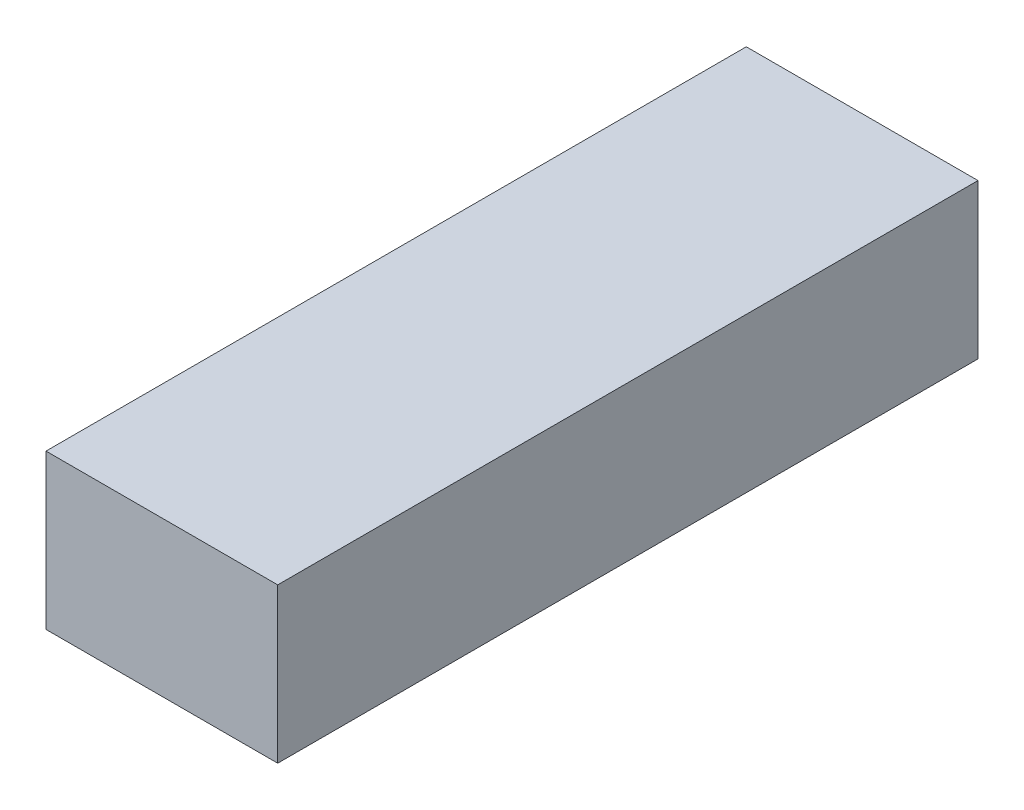
ISO-10303-21;
HEADER;
FILE_DESCRIPTION(('STEP AP214'),'2;1');
FILE_NAME('part.step','',(''),(''),'','','');
FILE_SCHEMA(('AUTOMOTIVE_DESIGN { 1 0 10303 214 1 1 1 1 }'));
ENDSEC;
DATA;
#1=APPLICATION_CONTEXT('core data for automotive mechanical design processes');
#2=APPLICATION_PROTOCOL_DEFINITION('international standard','automotive_design',2000,#1);
#3=PRODUCT_CONTEXT('',#1,'mechanical');
#4=PRODUCT('Part','Part','',(#3));
#5=PRODUCT_RELATED_PRODUCT_CATEGORY('part','',(#4));
#6=PRODUCT_DEFINITION_FORMATION('','',#4);
#7=PRODUCT_DEFINITION_CONTEXT('part definition',#1,'design');
#8=PRODUCT_DEFINITION('design','',#6,#7);
#9=PRODUCT_DEFINITION_SHAPE('','',#8);
#10=(LENGTH_UNIT() NAMED_UNIT(*) SI_UNIT(.MILLI.,.METRE.));
#11=(NAMED_UNIT(*) PLANE_ANGLE_UNIT() SI_UNIT($,.RADIAN.));
#12=(NAMED_UNIT(*) SI_UNIT($,.STERADIAN.) SOLID_ANGLE_UNIT());
#13=UNCERTAINTY_MEASURE_WITH_UNIT(LENGTH_MEASURE(1.E-05),#10,'distance_accuracy_value','');
#14=(GEOMETRIC_REPRESENTATION_CONTEXT(3) GLOBAL_UNCERTAINTY_ASSIGNED_CONTEXT((#13)) GLOBAL_UNIT_ASSIGNED_CONTEXT((#10,
#11,#12)) REPRESENTATION_CONTEXT('',''));
#15=CARTESIAN_POINT('',(0.,0.,0.));
#16=DIRECTION('',(0.,0.,1.));
#17=DIRECTION('',(1.,0.,0.));
#18=AXIS2_PLACEMENT_3D('',#15,#16,#17);
#19=CARTESIAN_POINT('',(22.5,-15.,136.));
#20=DIRECTION('',(-1.,0.,0.));
#21=DIRECTION('',(0.,0.,1.));
#22=AXIS2_PLACEMENT_3D('',#19,#20,#21);
#23=PLANE('',#22);
#24=DIRECTION('',(0.,1.,0.));
#25=VECTOR('',#24,1.);
#26=CARTESIAN_POINT('',(22.5,-15.,0.));
#27=LINE('',#26,#25);
#28=CARTESIAN_POINT('',(22.5,-15.,0.));
#29=VERTEX_POINT('',#28);
#30=CARTESIAN_POINT('',(22.5,15.,0.));
#31=VERTEX_POINT('',#30);
#32=EDGE_CURVE('E99',#29,#31,#27,.T.);
#33=ORIENTED_EDGE('',*,*,#32,.T.);
#34=DIRECTION('',(0.,0.,-1.));
#35=VECTOR('',#34,1.);
#36=CARTESIAN_POINT('',(22.5,15.,136.));
#37=LINE('',#36,#35);
#38=CARTESIAN_POINT('',(22.5,15.,136.));
#39=VERTEX_POINT('',#38);
#40=EDGE_CURVE('E11',#39,#31,#37,.T.);
#41=ORIENTED_EDGE('',*,*,#40,.F.);
#42=DIRECTION('',(0.,1.,0.));
#43=VECTOR('',#42,1.);
#44=CARTESIAN_POINT('',(22.5,-15.,136.));
#45=LINE('',#44,#43);
#46=CARTESIAN_POINT('',(22.5,-15.,136.));
#47=VERTEX_POINT('',#46);
#48=EDGE_CURVE('E87',#47,#39,#45,.T.);
#49=ORIENTED_EDGE('',*,*,#48,.F.);
#50=DIRECTION('',(0.,0.,-1.));
#51=VECTOR('',#50,1.);
#52=CARTESIAN_POINT('',(22.5,-15.,136.));
#53=LINE('',#52,#51);
#54=EDGE_CURVE('E95',#47,#29,#53,.T.);
#55=ORIENTED_EDGE('',*,*,#54,.T.);
#56=EDGE_LOOP('',(#33,#41,#49,#55));
#57=FACE_BOUND('',#56,.T.);
#58=ADVANCED_FACE('F36',(#57),#23,.F.);
#59=CARTESIAN_POINT('',(-22.5,15.,136.));
#60=DIRECTION('',(0.,-1.,0.));
#61=DIRECTION('',(0.,0.,-1.));
#62=AXIS2_PLACEMENT_3D('',#59,#60,#61);
#63=PLANE('',#62);
#64=DIRECTION('',(-1.,0.,0.));
#65=VECTOR('',#64,1.);
#66=CARTESIAN_POINT('',(-22.5,15.,0.));
#67=LINE('',#66,#65);
#68=CARTESIAN_POINT('',(-22.5,15.,0.));
#69=VERTEX_POINT('',#68);
#70=EDGE_CURVE('E91',#31,#69,#67,.T.);
#71=ORIENTED_EDGE('',*,*,#70,.T.);
#72=DIRECTION('',(0.,0.,-1.));
#73=VECTOR('',#72,1.);
#74=CARTESIAN_POINT('',(-22.5,15.,136.));
#75=LINE('',#74,#73);
#76=CARTESIAN_POINT('',(-22.5,15.,136.));
#77=VERTEX_POINT('',#76);
#78=EDGE_CURVE('E44',#77,#69,#75,.T.);
#79=ORIENTED_EDGE('',*,*,#78,.F.);
#80=DIRECTION('',(-1.,0.,0.));
#81=VECTOR('',#80,1.);
#82=CARTESIAN_POINT('',(-22.5,15.,136.));
#83=LINE('',#82,#81);
#84=EDGE_CURVE('E82',#39,#77,#83,.T.);
#85=ORIENTED_EDGE('',*,*,#84,.F.);
#86=ORIENTED_EDGE('',*,*,#40,.T.);
#87=EDGE_LOOP('',(#71,#79,#85,#86));
#88=FACE_BOUND('',#87,.T.);
#89=ADVANCED_FACE('F90',(#88),#63,.F.);
#90=CARTESIAN_POINT('',(-22.5,-15.,136.));
#91=DIRECTION('',(1.,0.,0.));
#92=DIRECTION('',(0.,0.,-1.));
#93=AXIS2_PLACEMENT_3D('',#90,#91,#92);
#94=PLANE('',#93);
#95=DIRECTION('',(0.,-1.,0.));
#96=VECTOR('',#95,1.);
#97=CARTESIAN_POINT('',(-22.5,-15.,0.));
#98=LINE('',#97,#96);
#99=CARTESIAN_POINT('',(-22.5,-15.,0.));
#100=VERTEX_POINT('',#99);
#101=EDGE_CURVE('E69',#69,#100,#98,.T.);
#102=ORIENTED_EDGE('',*,*,#101,.T.);
#103=DIRECTION('',(0.,0.,-1.));
#104=VECTOR('',#103,1.);
#105=CARTESIAN_POINT('',(-22.5,-15.,136.));
#106=LINE('',#105,#104);
#107=CARTESIAN_POINT('',(-22.5,-15.,136.));
#108=VERTEX_POINT('',#107);
#109=EDGE_CURVE('E92',#108,#100,#106,.T.);
#110=ORIENTED_EDGE('',*,*,#109,.F.);
#111=DIRECTION('',(0.,-1.,0.));
#112=VECTOR('',#111,1.);
#113=CARTESIAN_POINT('',(-22.5,-15.,136.));
#114=LINE('',#113,#112);
#115=EDGE_CURVE('E85',#77,#108,#114,.T.);
#116=ORIENTED_EDGE('',*,*,#115,.F.);
#117=ORIENTED_EDGE('',*,*,#78,.T.);
#118=EDGE_LOOP('',(#102,#110,#116,#117));
#119=FACE_BOUND('',#118,.T.);
#120=ADVANCED_FACE('F93',(#119),#94,.F.);
#121=CARTESIAN_POINT('',(-22.5,-15.,136.));
#122=DIRECTION('',(0.,1.,0.));
#123=DIRECTION('',(0.,0.,1.));
#124=AXIS2_PLACEMENT_3D('',#121,#122,#123);
#125=PLANE('',#124);
#126=DIRECTION('',(1.,0.,0.));
#127=VECTOR('',#126,1.);
#128=CARTESIAN_POINT('',(-22.5,-15.,0.));
#129=LINE('',#128,#127);
#130=EDGE_CURVE('E75',#100,#29,#129,.T.);
#131=ORIENTED_EDGE('',*,*,#130,.T.);
#132=ORIENTED_EDGE('',*,*,#54,.F.);
#133=DIRECTION('',(1.,0.,0.));
#134=VECTOR('',#133,1.);
#135=CARTESIAN_POINT('',(-22.5,-15.,136.));
#136=LINE('',#135,#134);
#137=EDGE_CURVE('E52',#108,#47,#136,.T.);
#138=ORIENTED_EDGE('',*,*,#137,.F.);
#139=ORIENTED_EDGE('',*,*,#109,.T.);
#140=EDGE_LOOP('',(#131,#132,#138,#139));
#141=FACE_BOUND('',#140,.T.);
#142=ADVANCED_FACE('F106',(#141),#125,.F.);
#143=CARTESIAN_POINT('',(0.,0.,136.));
#144=DIRECTION('',(0.,0.,-1.));
#145=DIRECTION('',(-1.,0.,0.));
#146=AXIS2_PLACEMENT_3D('',#143,#144,#145);
#147=PLANE('',#146);
#148=ORIENTED_EDGE('',*,*,#48,.T.);
#149=ORIENTED_EDGE('',*,*,#84,.T.);
#150=ORIENTED_EDGE('',*,*,#115,.T.);
#151=ORIENTED_EDGE('',*,*,#137,.T.);
#152=EDGE_LOOP('',(#148,#149,#150,#151));
#153=FACE_BOUND('',#152,.T.);
#154=ADVANCED_FACE('F83',(#153),#147,.F.);
#155=CARTESIAN_POINT('',(0.,0.,0.));
#156=DIRECTION('',(0.,0.,-1.));
#157=DIRECTION('',(-1.,0.,0.));
#158=AXIS2_PLACEMENT_3D('',#155,#156,#157);
#159=PLANE('',#158);
#160=ORIENTED_EDGE('',*,*,#32,.F.);
#161=ORIENTED_EDGE('',*,*,#130,.F.);
#162=ORIENTED_EDGE('',*,*,#101,.F.);
#163=ORIENTED_EDGE('',*,*,#70,.F.);
#164=EDGE_LOOP('',(#160,#161,#162,#163));
#165=FACE_BOUND('',#164,.T.);
#166=ADVANCED_FACE('F109',(#165),#159,.T.);
#167=CLOSED_SHELL('',(#58,#89,#120,#142,#154,#166));
#168=MANIFOLD_SOLID_BREP('B2',#167);
#169=ADVANCED_BREP_SHAPE_REPRESENTATION('',(#18,#168),#14);
#170=SHAPE_DEFINITION_REPRESENTATION(#9,#169);
ENDSEC;
END-ISO-10303-21;
